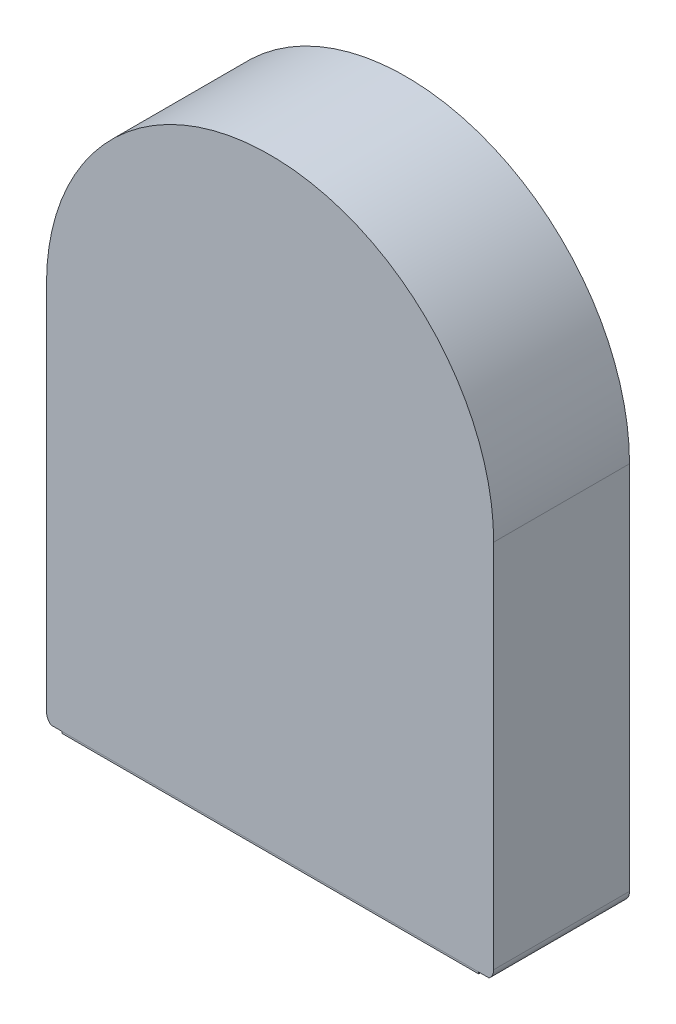
ISO-10303-21;
HEADER;
FILE_DESCRIPTION(('STEP AP214'),'2;1');
FILE_NAME('part.step','',(''),(''),'','','');
FILE_SCHEMA(('AUTOMOTIVE_DESIGN { 1 0 10303 214 1 1 1 1 }'));
ENDSEC;
DATA;
#1=APPLICATION_CONTEXT('core data for automotive mechanical design processes');
#2=APPLICATION_PROTOCOL_DEFINITION('international standard','automotive_design',2000,#1);
#3=PRODUCT_CONTEXT('',#1,'mechanical');
#4=PRODUCT('Part','Part','',(#3));
#5=PRODUCT_RELATED_PRODUCT_CATEGORY('part','',(#4));
#6=PRODUCT_DEFINITION_FORMATION('','',#4);
#7=PRODUCT_DEFINITION_CONTEXT('part definition',#1,'design');
#8=PRODUCT_DEFINITION('design','',#6,#7);
#9=PRODUCT_DEFINITION_SHAPE('','',#8);
#10=(LENGTH_UNIT() NAMED_UNIT(*) SI_UNIT(.MILLI.,.METRE.));
#11=(NAMED_UNIT(*) PLANE_ANGLE_UNIT() SI_UNIT($,.RADIAN.));
#12=(NAMED_UNIT(*) SI_UNIT($,.STERADIAN.) SOLID_ANGLE_UNIT());
#13=UNCERTAINTY_MEASURE_WITH_UNIT(LENGTH_MEASURE(1.E-05),#10,'distance_accuracy_value','');
#14=(GEOMETRIC_REPRESENTATION_CONTEXT(3) GLOBAL_UNCERTAINTY_ASSIGNED_CONTEXT((#13)) GLOBAL_UNIT_ASSIGNED_CONTEXT((#10,
#11,#12)) REPRESENTATION_CONTEXT('',''));
#15=CARTESIAN_POINT('',(0.,0.,0.));
#16=DIRECTION('',(0.,0.,1.));
#17=DIRECTION('',(1.,0.,0.));
#18=AXIS2_PLACEMENT_3D('',#15,#16,#17);
#19=CARTESIAN_POINT('',(8.8,-15.4,5.65));
#20=DIRECTION('',(0.,0.,-1.));
#21=DIRECTION('',(-1.,0.,0.));
#22=AXIS2_PLACEMENT_3D('',#19,#20,#21);
#23=CYLINDRICAL_SURFACE('',#22,0.5);
#24=CARTESIAN_POINT('',(8.8,-15.4,6.03039935251033));
#25=DIRECTION('',(0.,0.713250449154018,-0.700909264300018));
#26=DIRECTION('',(0.,0.700909264300018,0.713250449154018));
#27=AXIS2_PLACEMENT_3D('',#24,#25,#26);
#28=ELLIPSE('',#27,0.713359097199747,0.5);
#29=CARTESIAN_POINT('',(9.10934525688194,-15.79281740293,5.63066545920087));
#30=VERTEX_POINT('',#29);
#31=CARTESIAN_POINT('',(8.8,-15.9,5.52159565602451));
#32=VERTEX_POINT('',#31);
#33=EDGE_CURVE('E56',#30,#32,#28,.T.);
#34=ORIENTED_EDGE('',*,*,#33,.T.);
#35=DIRECTION('',(0.,0.,-1.));
#36=VECTOR('',#35,1.);
#37=CARTESIAN_POINT('',(8.8,-15.9,5.65));
#38=LINE('',#37,#36);
#39=CARTESIAN_POINT('',(8.8,-15.9,0.));
#40=VERTEX_POINT('',#39);
#41=EDGE_CURVE('E258',#40,#32,#38,.F.);
#42=ORIENTED_EDGE('',*,*,#41,.F.);
#43=CARTESIAN_POINT('',(8.8,-15.4,0.));
#44=DIRECTION('',(0.,0.,1.));
#45=DIRECTION('',(1.,0.,0.));
#46=AXIS2_PLACEMENT_3D('',#43,#44,#45);
#47=CIRCLE('',#46,0.5);
#48=CARTESIAN_POINT('',(9.3,-15.4,0.));
#49=VERTEX_POINT('',#48);
#50=EDGE_CURVE('E262',#49,#40,#47,.F.);
#51=ORIENTED_EDGE('',*,*,#50,.F.);
#52=DIRECTION('',(0.,0.,-1.));
#53=VECTOR('',#52,1.);
#54=CARTESIAN_POINT('',(9.3,-15.4,5.65));
#55=LINE('',#54,#53);
#56=CARTESIAN_POINT('',(9.3,-15.4,5.65));
#57=VERTEX_POINT('',#56);
#58=EDGE_CURVE('E266',#57,#49,#55,.T.);
#59=ORIENTED_EDGE('',*,*,#58,.F.);
#60=CARTESIAN_POINT('',(8.8,-15.4,5.65));
#61=DIRECTION('',(0.,0.,1.));
#62=DIRECTION('',(1.,0.,0.));
#63=AXIS2_PLACEMENT_3D('',#60,#61,#62);
#64=CIRCLE('',#63,0.5);
#65=CARTESIAN_POINT('',(9.10934525688194,-15.79281740293,5.65));
#66=VERTEX_POINT('',#65);
#67=EDGE_CURVE('E253',#66,#57,#64,.T.);
#68=ORIENTED_EDGE('',*,*,#67,.F.);
#69=DIRECTION('',(0.,0.,-1.));
#70=VECTOR('',#69,1.);
#71=CARTESIAN_POINT('',(9.10934525730095,-15.7928174026,5.65));
#72=LINE('',#71,#70);
#73=EDGE_CURVE('E49',#30,#66,#72,.F.);
#74=ORIENTED_EDGE('',*,*,#73,.F.);
#75=EDGE_LOOP('',(#34,#42,#51,#59,#68,#74));
#76=FACE_BOUND('',#75,.T.);
#77=ADVANCED_FACE('F39',(#76),#23,.T.);
#78=CARTESIAN_POINT('',(-8.8,-15.4,5.65));
#79=DIRECTION('',(0.,0.,-1.));
#80=DIRECTION('',(-1.,0.,0.));
#81=AXIS2_PLACEMENT_3D('',#78,#79,#80);
#82=CYLINDRICAL_SURFACE('',#81,0.5);
#83=CARTESIAN_POINT('',(-8.8,-15.4,5.65));
#84=DIRECTION('',(0.,0.,1.));
#85=DIRECTION('',(1.,0.,0.));
#86=AXIS2_PLACEMENT_3D('',#83,#84,#85);
#87=CIRCLE('',#86,0.5);
#88=CARTESIAN_POINT('',(-9.3,-15.4,5.65));
#89=VERTEX_POINT('',#88);
#90=CARTESIAN_POINT('',(-9.10934525730095,-15.7928174026,5.65));
#91=VERTEX_POINT('',#90);
#92=EDGE_CURVE('E255',#89,#91,#87,.T.);
#93=ORIENTED_EDGE('',*,*,#92,.F.);
#94=DIRECTION('',(0.,0.,-1.));
#95=VECTOR('',#94,1.);
#96=CARTESIAN_POINT('',(-9.3,-15.4,5.65));
#97=LINE('',#96,#95);
#98=CARTESIAN_POINT('',(-9.3,-15.4,0.));
#99=VERTEX_POINT('',#98);
#100=EDGE_CURVE('E251',#99,#89,#97,.F.);
#101=ORIENTED_EDGE('',*,*,#100,.F.);
#102=CARTESIAN_POINT('',(-8.8,-15.4,0.));
#103=DIRECTION('',(0.,0.,1.));
#104=DIRECTION('',(1.,0.,0.));
#105=AXIS2_PLACEMENT_3D('',#102,#103,#104);
#106=CIRCLE('',#105,0.5);
#107=CARTESIAN_POINT('',(-8.8,-15.9,0.));
#108=VERTEX_POINT('',#107);
#109=EDGE_CURVE('E264',#108,#99,#106,.F.);
#110=ORIENTED_EDGE('',*,*,#109,.F.);
#111=DIRECTION('',(0.,0.,-1.));
#112=VECTOR('',#111,1.);
#113=CARTESIAN_POINT('',(-8.8,-15.9,5.65));
#114=LINE('',#113,#112);
#115=CARTESIAN_POINT('',(-8.8,-15.9,5.52159565602451));
#116=VERTEX_POINT('',#115);
#117=EDGE_CURVE('E260',#116,#108,#114,.T.);
#118=ORIENTED_EDGE('',*,*,#117,.F.);
#119=CARTESIAN_POINT('',(-8.8,-15.4,6.03039935251033));
#120=DIRECTION('',(0.,0.713250449154018,-0.700909264300018));
#121=DIRECTION('',(0.,0.700909264300018,0.713250449154018));
#122=AXIS2_PLACEMENT_3D('',#119,#120,#121);
#123=ELLIPSE('',#122,0.713359097199747,0.5);
#124=CARTESIAN_POINT('',(-9.10934525730095,-15.7928174026,5.63066545953665));
#125=VERTEX_POINT('',#124);
#126=EDGE_CURVE('E146',#116,#125,#123,.T.);
#127=ORIENTED_EDGE('',*,*,#126,.T.);
#128=DIRECTION('',(0.,0.,1.));
#129=VECTOR('',#128,1.);
#130=CARTESIAN_POINT('',(-9.10934525730095,-15.7928174026,5.63066545953665));
#131=LINE('',#130,#129);
#132=EDGE_CURVE('E196',#125,#91,#131,.T.);
#133=ORIENTED_EDGE('',*,*,#132,.T.);
#134=EDGE_LOOP('',(#93,#101,#110,#118,#127,#133));
#135=FACE_BOUND('',#134,.T.);
#136=ADVANCED_FACE('F41',(#135),#82,.T.);
#137=CARTESIAN_POINT('',(0.,0.,5.65));
#138=DIRECTION('',(0.,0.,-1.));
#139=DIRECTION('',(-1.,0.,0.));
#140=AXIS2_PLACEMENT_3D('',#137,#138,#139);
#141=CYLINDRICAL_SURFACE('',#140,9.3);
#142=CARTESIAN_POINT('',(0.,0.,0.));
#143=DIRECTION('',(0.,0.,1.));
#144=DIRECTION('',(1.,0.,0.));
#145=AXIS2_PLACEMENT_3D('',#142,#143,#144);
#146=CIRCLE('',#145,9.3);
#147=CARTESIAN_POINT('',(9.3,0.,0.));
#148=VERTEX_POINT('',#147);
#149=CARTESIAN_POINT('',(-9.3,0.,0.));
#150=VERTEX_POINT('',#149);
#151=EDGE_CURVE('E201',#148,#150,#146,.T.);
#152=ORIENTED_EDGE('',*,*,#151,.T.);
#153=DIRECTION('',(0.,0.,-1.));
#154=VECTOR('',#153,1.);
#155=CARTESIAN_POINT('',(-9.3,0.,5.65));
#156=LINE('',#155,#154);
#157=CARTESIAN_POINT('',(-9.3,0.,5.65));
#158=VERTEX_POINT('',#157);
#159=EDGE_CURVE('E268',#158,#150,#156,.T.);
#160=ORIENTED_EDGE('',*,*,#159,.F.);
#161=CARTESIAN_POINT('',(0.,0.,5.65));
#162=DIRECTION('',(0.,0.,1.));
#163=DIRECTION('',(1.,0.,0.));
#164=AXIS2_PLACEMENT_3D('',#161,#162,#163);
#165=CIRCLE('',#164,9.3);
#166=CARTESIAN_POINT('',(9.3,0.,5.65));
#167=VERTEX_POINT('',#166);
#168=EDGE_CURVE('E245',#167,#158,#165,.T.);
#169=ORIENTED_EDGE('',*,*,#168,.F.);
#170=DIRECTION('',(0.,0.,-1.));
#171=VECTOR('',#170,1.);
#172=CARTESIAN_POINT('',(9.3,0.,5.65));
#173=LINE('',#172,#171);
#174=EDGE_CURVE('E270',#167,#148,#173,.T.);
#175=ORIENTED_EDGE('',*,*,#174,.T.);
#176=EDGE_LOOP('',(#152,#160,#169,#175));
#177=FACE_BOUND('',#176,.T.);
#178=ADVANCED_FACE('F358',(#177),#141,.T.);
#179=CARTESIAN_POINT('',(-9.3,0.,5.65));
#180=DIRECTION('',(1.,0.,0.));
#181=DIRECTION('',(0.,1.,0.));
#182=AXIS2_PLACEMENT_3D('',#179,#180,#181);
#183=PLANE('',#182);
#184=ORIENTED_EDGE('',*,*,#159,.T.);
#185=DIRECTION('',(0.,-1.,0.));
#186=VECTOR('',#185,1.);
#187=CARTESIAN_POINT('',(-9.3,0.,0.));
#188=LINE('',#187,#186);
#189=EDGE_CURVE('E278',#150,#99,#188,.T.);
#190=ORIENTED_EDGE('',*,*,#189,.T.);
#191=ORIENTED_EDGE('',*,*,#100,.T.);
#192=DIRECTION('',(0.,-1.,0.));
#193=VECTOR('',#192,1.);
#194=CARTESIAN_POINT('',(-9.3,0.,5.65));
#195=LINE('',#194,#193);
#196=EDGE_CURVE('E242',#158,#89,#195,.T.);
#197=ORIENTED_EDGE('',*,*,#196,.F.);
#198=EDGE_LOOP('',(#184,#190,#191,#197));
#199=FACE_BOUND('',#198,.T.);
#200=ADVANCED_FACE('F359',(#199),#183,.F.);
#201=CARTESIAN_POINT('',(-9.3,-15.9,5.65));
#202=DIRECTION('',(0.,1.,0.));
#203=DIRECTION('',(0.,0.,1.));
#204=AXIS2_PLACEMENT_3D('',#201,#202,#203);
#205=PLANE('',#204);
#206=ORIENTED_EDGE('',*,*,#41,.T.);
#207=DIRECTION('',(-1.,0.,0.));
#208=VECTOR('',#207,1.);
#209=CARTESIAN_POINT('',(0.,-15.9,5.52159565602451));
#210=LINE('',#209,#208);
#211=EDGE_CURVE('E338',#32,#116,#210,.T.);
#212=ORIENTED_EDGE('',*,*,#211,.T.);
#213=ORIENTED_EDGE('',*,*,#117,.T.);
#214=DIRECTION('',(1.,0.,0.));
#215=VECTOR('',#214,1.);
#216=CARTESIAN_POINT('',(-9.3,-15.9,0.));
#217=LINE('',#216,#215);
#218=EDGE_CURVE('E275',#108,#40,#217,.T.);
#219=ORIENTED_EDGE('',*,*,#218,.T.);
#220=EDGE_LOOP('',(#206,#212,#213,#219));
#221=FACE_BOUND('',#220,.T.);
#222=ADVANCED_FACE('F344',(#221),#205,.F.);
#223=CARTESIAN_POINT('',(9.3,0.,5.65));
#224=DIRECTION('',(-1.,0.,0.));
#225=DIRECTION('',(0.,-1.,0.));
#226=AXIS2_PLACEMENT_3D('',#223,#224,#225);
#227=PLANE('',#226);
#228=ORIENTED_EDGE('',*,*,#58,.T.);
#229=DIRECTION('',(0.,1.,0.));
#230=VECTOR('',#229,1.);
#231=CARTESIAN_POINT('',(9.3,0.,0.));
#232=LINE('',#231,#230);
#233=EDGE_CURVE('E248',#49,#148,#232,.T.);
#234=ORIENTED_EDGE('',*,*,#233,.T.);
#235=ORIENTED_EDGE('',*,*,#174,.F.);
#236=DIRECTION('',(0.,1.,0.));
#237=VECTOR('',#236,1.);
#238=CARTESIAN_POINT('',(9.3,0.,5.65));
#239=LINE('',#238,#237);
#240=EDGE_CURVE('E272',#57,#167,#239,.T.);
#241=ORIENTED_EDGE('',*,*,#240,.F.);
#242=EDGE_LOOP('',(#228,#234,#235,#241));
#243=FACE_BOUND('',#242,.T.);
#244=ADVANCED_FACE('F355',(#243),#227,.F.);
#245=CARTESIAN_POINT('',(0.,0.,5.65));
#246=DIRECTION('',(0.,0.,1.));
#247=DIRECTION('',(1.,0.,0.));
#248=AXIS2_PLACEMENT_3D('',#245,#246,#247);
#249=PLANE('',#248);
#250=DIRECTION('',(1.,0.,0.));
#251=VECTOR('',#250,1.);
#252=CARTESIAN_POINT('',(-5.00000000075,-15.7926514013,5.64999710245));
#253=LINE('',#252,#251);
#254=CARTESIAN_POINT('',(-6.97971042440521,-15.7927344019421,5.64999855122482));
#255=VERTEX_POINT('',#254);
#256=CARTESIAN_POINT('',(2.97381740255382,-15.7926513759911,5.64999855122139));
#257=VERTEX_POINT('',#256);
#258=EDGE_CURVE('E177',#255,#257,#253,.T.);
#259=ORIENTED_EDGE('',*,*,#258,.T.);
#260=DIRECTION('',(0.999999999999744,1.24820653344968E-08,7.15097058320817E-07));
#261=VECTOR('',#260,1.);
#262=CARTESIAN_POINT('',(4.99999999925,-15.792651376,5.64999855136));
#263=LINE('',#262,#261);
#264=CARTESIAN_POINT('',(6.97971041935568,-15.7927343769389,5.64999998352249));
#265=VERTEX_POINT('',#264);
#266=EDGE_CURVE('E180',#257,#265,#263,.T.);
#267=ORIENTED_EDGE('',*,*,#266,.T.);
#268=DIRECTION('',(-1.,0.,0.));
#269=VECTOR('',#268,1.);
#270=CARTESIAN_POINT('',(0.,-15.7928174026,5.65));
#271=LINE('',#270,#269);
#272=EDGE_CURVE('E199',#66,#265,#271,.T.);
#273=ORIENTED_EDGE('',*,*,#272,.F.);
#274=ORIENTED_EDGE('',*,*,#67,.T.);
#275=ORIENTED_EDGE('',*,*,#240,.T.);
#276=ORIENTED_EDGE('',*,*,#168,.T.);
#277=ORIENTED_EDGE('',*,*,#196,.T.);
#278=ORIENTED_EDGE('',*,*,#92,.T.);
#279=DIRECTION('',(-1.,0.,0.));
#280=VECTOR('',#279,1.);
#281=CARTESIAN_POINT('',(0.,-15.7928174026,5.65));
#282=LINE('',#281,#280);
#283=EDGE_CURVE('E11',#255,#91,#282,.T.);
#284=ORIENTED_EDGE('',*,*,#283,.F.);
#285=EDGE_LOOP('',(#259,#267,#273,#274,#275,#276,#277,#278,#284));
#286=FACE_BOUND('',#285,.T.);
#287=ADVANCED_FACE('F288',(#286),#249,.T.);
#288=CARTESIAN_POINT('',(0.,0.,0.));
#289=DIRECTION('',(0.,0.,1.));
#290=DIRECTION('',(1.,0.,0.));
#291=AXIS2_PLACEMENT_3D('',#288,#289,#290);
#292=PLANE('',#291);
#293=ORIENTED_EDGE('',*,*,#233,.F.);
#294=ORIENTED_EDGE('',*,*,#50,.T.);
#295=ORIENTED_EDGE('',*,*,#218,.F.);
#296=ORIENTED_EDGE('',*,*,#109,.T.);
#297=ORIENTED_EDGE('',*,*,#189,.F.);
#298=ORIENTED_EDGE('',*,*,#151,.F.);
#299=EDGE_LOOP('',(#293,#294,#295,#296,#297,#298));
#300=FACE_BOUND('',#299,.T.);
#301=ADVANCED_FACE('F221',(#300),#292,.F.);
#302=CARTESIAN_POINT('',(-10.,-15.7928174026,7.15));
#303=DIRECTION('',(0.,1.,0.));
#304=DIRECTION('',(0.,0.,1.));
#305=AXIS2_PLACEMENT_3D('',#302,#303,#304);
#306=PLANE('',#305);
#307=ORIENTED_EDGE('',*,*,#272,.T.);
#308=CARTESIAN_POINT('',(6.97975192830906,-15.7928174026,5.64048689252252));
#309=DIRECTION('',(-0.00436264473487639,0.0174522403538263,0.999838180225955));
#310=VECTOR('',#309,1.);
#311=LINE('',#308,#310);
#312=CARTESIAN_POINT('',(6.97975192830905,-15.7928174026,5.64048689252252));
#313=VERTEX_POINT('',#312);
#314=EDGE_CURVE('E188',#313,#265,#311,.T.);
#315=ORIENTED_EDGE('',*,*,#314,.F.);
#316=DIRECTION('',(1.,0.,0.));
#317=VECTOR('',#316,1.);
#318=CARTESIAN_POINT('',(-8.66700053469144,-15.7928174026,5.64048689252252));
#319=LINE('',#318,#317);
#320=CARTESIAN_POINT('',(8.66820089689577,-15.7928174026,5.64048689252252));
#321=VERTEX_POINT('',#320);
#322=EDGE_CURVE('E161',#313,#321,#319,.T.);
#323=ORIENTED_EDGE('',*,*,#322,.T.);
#324=DIRECTION('',(0.,0.,-1.));
#325=VECTOR('',#324,1.);
#326=CARTESIAN_POINT('',(8.66820089689577,-15.7928174026,0.999999999999998));
#327=LINE('',#326,#325);
#328=CARTESIAN_POINT('',(8.66821322781486,-15.7928174036935,5.63066545842397));
#329=VERTEX_POINT('',#328);
#330=EDGE_CURVE('E153',#321,#329,#327,.T.);
#331=ORIENTED_EDGE('',*,*,#330,.T.);
#332=DIRECTION('',(-1.,-1.73074002985439E-09,-1.7612138496918E-09));
#333=VECTOR('',#332,1.);
#334=CARTESIAN_POINT('',(-4.9999999983754,-15.7928174273496,5.6306654343513));
#335=LINE('',#334,#333);
#336=EDGE_CURVE('E137',#30,#329,#335,.T.);
#337=ORIENTED_EDGE('',*,*,#336,.F.);
#338=ORIENTED_EDGE('',*,*,#73,.T.);
#339=EDGE_LOOP('',(#307,#315,#323,#331,#337,#338));
#340=FACE_BOUND('',#339,.T.);
#341=ADVANCED_FACE('F158',(#340),#306,.F.);
#342=CARTESIAN_POINT('',(8.27396970801,-15.8738174032,0.999999999999998));
#343=DIRECTION('',(0.,-1.,0.));
#344=DIRECTION('',(0.,0.,-1.));
#345=AXIS2_PLACEMENT_3D('',#342,#343,#344);
#346=PLANE('',#345);
#347=DIRECTION('',(1.,0.,0.));
#348=VECTOR('',#347,1.);
#349=CARTESIAN_POINT('',(8.27396970801,-15.8738174032,5.54823926009538));
#350=LINE('',#349,#348);
#351=CARTESIAN_POINT('',(-8.66700053469144,-15.8738174032,5.54823926009538));
#352=VERTEX_POINT('',#351);
#353=CARTESIAN_POINT('',(8.66820089689577,-15.8738174032,5.54823926009538));
#354=VERTEX_POINT('',#353);
#355=EDGE_CURVE('E156',#352,#354,#350,.T.);
#356=ORIENTED_EDGE('',*,*,#355,.T.);
#357=DIRECTION('',(0.,0.,-1.));
#358=VECTOR('',#357,1.);
#359=CARTESIAN_POINT('',(8.66820089689577,-15.8738174032,0.999999999999998));
#360=LINE('',#359,#358);
#361=CARTESIAN_POINT('',(8.66820089689577,-15.8738174032,5.64048689252252));
#362=VERTEX_POINT('',#361);
#363=EDGE_CURVE('E154',#362,#354,#360,.T.);
#364=ORIENTED_EDGE('',*,*,#363,.F.);
#365=DIRECTION('',(1.,0.,0.));
#366=VECTOR('',#365,1.);
#367=CARTESIAN_POINT('',(-8.66700053469144,-15.8738174032,5.64048689252252));
#368=LINE('',#367,#366);
#369=CARTESIAN_POINT('',(-8.66700053469144,-15.8738174032,5.64048689252252));
#370=VERTEX_POINT('',#369);
#371=EDGE_CURVE('E163',#370,#362,#368,.T.);
#372=ORIENTED_EDGE('',*,*,#371,.F.);
#373=DIRECTION('',(0.,0.,1.));
#374=VECTOR('',#373,1.);
#375=CARTESIAN_POINT('',(-8.66700053469144,-15.8738174032,0.999999999999998));
#376=LINE('',#375,#374);
#377=EDGE_CURVE('E322',#352,#370,#376,.T.);
#378=ORIENTED_EDGE('',*,*,#377,.F.);
#379=EDGE_LOOP('',(#356,#364,#372,#378));
#380=FACE_BOUND('',#379,.T.);
#381=ADVANCED_FACE('F220',(#380),#346,.T.);
#382=ORIENTED_EDGE('',*,*,#283,.T.);
#383=ORIENTED_EDGE('',*,*,#132,.F.);
#384=DIRECTION('',(-1.,0.,0.));
#385=VECTOR('',#384,1.);
#386=CARTESIAN_POINT('',(-10.,-15.7928174026,5.63066545953665));
#387=LINE('',#386,#385);
#388=CARTESIAN_POINT('',(-8.66700053469144,-15.7928174026,5.63066545953665));
#389=VERTEX_POINT('',#388);
#390=EDGE_CURVE('E298',#389,#125,#387,.T.);
#391=ORIENTED_EDGE('',*,*,#390,.F.);
#392=DIRECTION('',(0.,0.,1.));
#393=VECTOR('',#392,1.);
#394=CARTESIAN_POINT('',(-8.66700053469144,-15.7928174026,0.999999999999998));
#395=LINE('',#394,#393);
#396=CARTESIAN_POINT('',(-8.66700053469144,-15.7928174026,5.64048689252252));
#397=VERTEX_POINT('',#396);
#398=EDGE_CURVE('E155',#389,#397,#395,.T.);
#399=ORIENTED_EDGE('',*,*,#398,.T.);
#400=CARTESIAN_POINT('',(-6.97975192710905,-15.7928174026,5.64048689252252));
#401=VERTEX_POINT('',#400);
#402=EDGE_CURVE('E164',#397,#401,#319,.T.);
#403=ORIENTED_EDGE('',*,*,#402,.T.);
#404=CARTESIAN_POINT('',(-6.97971043072667,-15.7926514012683,5.64999710244945));
#405=DIRECTION('',(-0.00436264475399805,-0.0174522403537114,-0.999838180225874));
#406=VECTOR('',#405,1.);
#407=LINE('',#404,#406);
#408=EDGE_CURVE('E204',#255,#401,#407,.T.);
#409=ORIENTED_EDGE('',*,*,#408,.F.);
#410=EDGE_LOOP('',(#382,#383,#391,#399,#403,#409));
#411=FACE_BOUND('',#410,.T.);
#412=ADVANCED_FACE('F222',(#411),#306,.F.);
#413=CARTESIAN_POINT('',(8.66820089689577,-33.8193830747908,0.999999999999998));
#414=DIRECTION('',(1.,0.,0.));
#415=DIRECTION('',(0.,0.,-1.));
#416=AXIS2_PLACEMENT_3D('',#413,#414,#415);
#417=PLANE('',#416);
#418=DIRECTION('',(0.,0.700909264300018,0.713250449154018));
#419=VECTOR('',#418,1.);
#420=CARTESIAN_POINT('',(8.66820089689578,-26.9637768566889,-5.73698546753076));
#421=LINE('',#420,#419);
#422=EDGE_CURVE('E141',#354,#329,#421,.T.);
#423=ORIENTED_EDGE('',*,*,#422,.T.);
#424=ORIENTED_EDGE('',*,*,#330,.F.);
#425=DIRECTION('',(0.,1.,0.));
#426=VECTOR('',#425,1.);
#427=CARTESIAN_POINT('',(8.66820089689577,-33.8193830747908,5.64048689252252));
#428=LINE('',#427,#426);
#429=EDGE_CURVE('E167',#362,#321,#428,.T.);
#430=ORIENTED_EDGE('',*,*,#429,.F.);
#431=ORIENTED_EDGE('',*,*,#363,.T.);
#432=EDGE_LOOP('',(#423,#424,#430,#431));
#433=FACE_BOUND('',#432,.T.);
#434=ADVANCED_FACE('F151',(#433),#417,.T.);
#435=CARTESIAN_POINT('',(-8.66700053469144,-33.8193830747908,0.999999999999998));
#436=DIRECTION('',(-1.,0.,0.));
#437=DIRECTION('',(0.,0.,1.));
#438=AXIS2_PLACEMENT_3D('',#435,#436,#437);
#439=PLANE('',#438);
#440=DIRECTION('',(0.,-0.700909264300018,-0.713250449154018));
#441=VECTOR('',#440,1.);
#442=CARTESIAN_POINT('',(-8.66700053469144,-26.9637768566889,-5.73698546753076));
#443=LINE('',#442,#441);
#444=EDGE_CURVE('E147',#389,#352,#443,.T.);
#445=ORIENTED_EDGE('',*,*,#444,.T.);
#446=ORIENTED_EDGE('',*,*,#377,.T.);
#447=DIRECTION('',(0.,1.,0.));
#448=VECTOR('',#447,1.);
#449=CARTESIAN_POINT('',(-8.66700053469144,-33.8193830747908,5.64048689252252));
#450=LINE('',#449,#448);
#451=EDGE_CURVE('E324',#370,#397,#450,.T.);
#452=ORIENTED_EDGE('',*,*,#451,.T.);
#453=ORIENTED_EDGE('',*,*,#398,.F.);
#454=EDGE_LOOP('',(#445,#446,#452,#453));
#455=FACE_BOUND('',#454,.T.);
#456=ADVANCED_FACE('F438',(#455),#439,.T.);
#457=CARTESIAN_POINT('',(9.3,-15.9,-0.500000000000002));
#458=DIRECTION('',(0.,-0.999847695156391,0.0174524064373068));
#459=DIRECTION('',(-1.,0.,0.));
#460=AXIS2_PLACEMENT_3D('',#457,#458,#459);
#461=PLANE('',#460);
#462=ORIENTED_EDGE('',*,*,#314,.T.);
#463=ORIENTED_EDGE('',*,*,#266,.F.);
#464=ORIENTED_EDGE('',*,*,#258,.F.);
#465=ORIENTED_EDGE('',*,*,#408,.T.);
#466=DIRECTION('',(-1.,0.,0.));
#467=VECTOR('',#466,1.);
#468=CARTESIAN_POINT('',(9.3,-15.7928174026,5.64048689252304));
#469=LINE('',#468,#467);
#470=EDGE_CURVE('E181',#313,#401,#469,.T.);
#471=ORIENTED_EDGE('',*,*,#470,.F.);
#472=EDGE_LOOP('',(#462,#463,#464,#465,#471));
#473=FACE_BOUND('',#472,.T.);
#474=ADVANCED_FACE('F225',(#473),#461,.T.);
#475=CARTESIAN_POINT('',(-8.66700053469144,-33.8193830747908,5.64048689252252));
#476=DIRECTION('',(0.,0.,1.));
#477=DIRECTION('',(1.,0.,0.));
#478=AXIS2_PLACEMENT_3D('',#475,#476,#477);
#479=PLANE('',#478);
#480=ORIENTED_EDGE('',*,*,#451,.F.);
#481=ORIENTED_EDGE('',*,*,#371,.T.);
#482=ORIENTED_EDGE('',*,*,#429,.T.);
#483=ORIENTED_EDGE('',*,*,#322,.F.);
#484=ORIENTED_EDGE('',*,*,#470,.T.);
#485=ORIENTED_EDGE('',*,*,#402,.F.);
#486=EDGE_LOOP('',(#480,#481,#482,#483,#484,#485));
#487=FACE_BOUND('',#486,.T.);
#488=ADVANCED_FACE('F223',(#487),#479,.T.);
#489=CARTESIAN_POINT('',(-5.,-15.3316709855,6.09993146282));
#490=DIRECTION('',(0.,0.713250449154018,-0.700909264300018));
#491=DIRECTION('',(-1.,0.,0.));
#492=AXIS2_PLACEMENT_3D('',#489,#490,#491);
#493=PLANE('',#492);
#494=ORIENTED_EDGE('',*,*,#336,.T.);
#495=ORIENTED_EDGE('',*,*,#422,.F.);
#496=ORIENTED_EDGE('',*,*,#355,.F.);
#497=ORIENTED_EDGE('',*,*,#444,.F.);
#498=ORIENTED_EDGE('',*,*,#390,.T.);
#499=ORIENTED_EDGE('',*,*,#126,.F.);
#500=ORIENTED_EDGE('',*,*,#211,.F.);
#501=ORIENTED_EDGE('',*,*,#33,.F.);
#502=EDGE_LOOP('',(#494,#495,#496,#497,#498,#499,#500,#501));
#503=FACE_BOUND('',#502,.T.);
#504=ADVANCED_FACE('F139',(#503),#493,.F.);
#505=CLOSED_SHELL('',(#77,#136,#178,#200,#222,#244,#287,#301,#341,#381,#412,#434,#456,#474,#488,#504));
#506=MANIFOLD_SOLID_BREP('B2',#505);
#507=ADVANCED_BREP_SHAPE_REPRESENTATION('',(#18,#506),#14);
#508=SHAPE_DEFINITION_REPRESENTATION(#9,#507);
ENDSEC;
END-ISO-10303-21;
